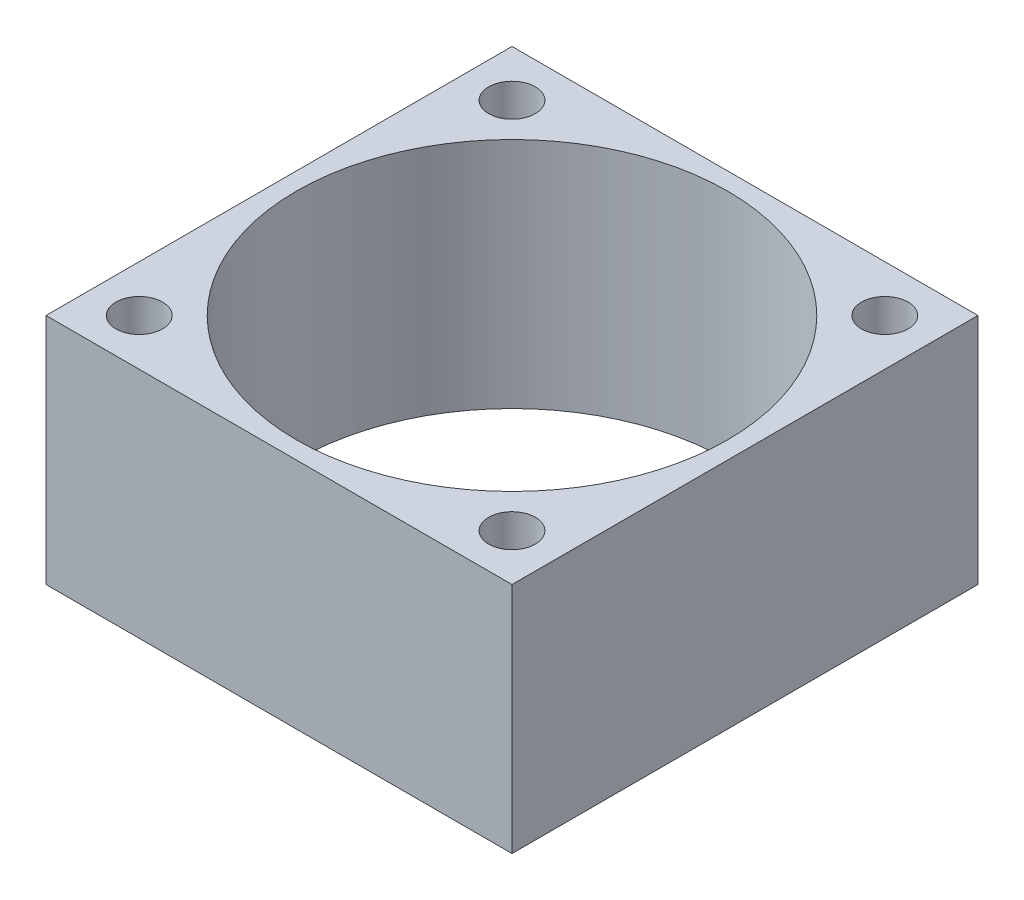
ISO-10303-21;
HEADER;
FILE_DESCRIPTION(('STEP AP214'),'2;1');
FILE_NAME('part.step','',(''),(''),'','','');
FILE_SCHEMA(('AUTOMOTIVE_DESIGN { 1 0 10303 214 1 1 1 1 }'));
ENDSEC;
DATA;
#1=APPLICATION_CONTEXT('core data for automotive mechanical design processes');
#2=APPLICATION_PROTOCOL_DEFINITION('international standard','automotive_design',2000,#1);
#3=PRODUCT_CONTEXT('',#1,'mechanical');
#4=PRODUCT('Part','Part','',(#3));
#5=PRODUCT_RELATED_PRODUCT_CATEGORY('part','',(#4));
#6=PRODUCT_DEFINITION_FORMATION('','',#4);
#7=PRODUCT_DEFINITION_CONTEXT('part definition',#1,'design');
#8=PRODUCT_DEFINITION('design','',#6,#7);
#9=PRODUCT_DEFINITION_SHAPE('','',#8);
#10=(LENGTH_UNIT() NAMED_UNIT(*) SI_UNIT(.MILLI.,.METRE.));
#11=(NAMED_UNIT(*) PLANE_ANGLE_UNIT() SI_UNIT($,.RADIAN.));
#12=(NAMED_UNIT(*) SI_UNIT($,.STERADIAN.) SOLID_ANGLE_UNIT());
#13=UNCERTAINTY_MEASURE_WITH_UNIT(LENGTH_MEASURE(1.E-05),#10,'distance_accuracy_value','');
#14=(GEOMETRIC_REPRESENTATION_CONTEXT(3) GLOBAL_UNCERTAINTY_ASSIGNED_CONTEXT((#13)) GLOBAL_UNIT_ASSIGNED_CONTEXT((#10,
#11,#12)) REPRESENTATION_CONTEXT('',''));
#15=CARTESIAN_POINT('',(0.,0.,0.));
#16=DIRECTION('',(0.,0.,1.));
#17=DIRECTION('',(1.,0.,0.));
#18=AXIS2_PLACEMENT_3D('',#15,#16,#17);
#19=CARTESIAN_POINT('',(0.,20.,0.));
#20=DIRECTION('',(0.,-1.,0.));
#21=DIRECTION('',(0.,0.,-1.));
#22=AXIS2_PLACEMENT_3D('',#19,#20,#21);
#23=PLANE('',#22);
#24=CARTESIAN_POINT('',(-36.,20.,4.));
#25=DIRECTION('',(0.,1.,0.));
#26=DIRECTION('',(0.,0.,1.));
#27=AXIS2_PLACEMENT_3D('',#24,#25,#26);
#28=CIRCLE('',#27,2.);
#29=CARTESIAN_POINT('',(-36.,20.,6.00000000000001));
#30=VERTEX_POINT('',#29);
#31=EDGE_CURVE('E140',#30,#30,#28,.T.);
#32=ORIENTED_EDGE('',*,*,#31,.F.);
#33=EDGE_LOOP('',(#32));
#34=FACE_BOUND('',#33,.T.);
#35=CARTESIAN_POINT('',(-20.,20.,20.));
#36=DIRECTION('',(0.,1.,0.));
#37=DIRECTION('',(0.,0.,1.));
#38=AXIS2_PLACEMENT_3D('',#35,#36,#37);
#39=CIRCLE('',#38,18.5);
#40=CARTESIAN_POINT('',(-20.,20.,38.5));
#41=VERTEX_POINT('',#40);
#42=EDGE_CURVE('E158',#41,#41,#39,.T.);
#43=ORIENTED_EDGE('',*,*,#42,.F.);
#44=EDGE_LOOP('',(#43));
#45=FACE_BOUND('',#44,.T.);
#46=CARTESIAN_POINT('',(-3.99999999999999,20.,4.));
#47=DIRECTION('',(0.,1.,0.));
#48=DIRECTION('',(0.,0.,1.));
#49=AXIS2_PLACEMENT_3D('',#46,#47,#48);
#50=CIRCLE('',#49,2.);
#51=CARTESIAN_POINT('',(-3.99999999999999,20.,6.));
#52=VERTEX_POINT('',#51);
#53=EDGE_CURVE('E137',#52,#52,#50,.T.);
#54=ORIENTED_EDGE('',*,*,#53,.F.);
#55=EDGE_LOOP('',(#54));
#56=FACE_BOUND('',#55,.T.);
#57=DIRECTION('',(0.,0.,-1.));
#58=VECTOR('',#57,1.);
#59=CARTESIAN_POINT('',(0.,20.,0.));
#60=LINE('',#59,#58);
#61=CARTESIAN_POINT('',(0.,20.,40.));
#62=VERTEX_POINT('',#61);
#63=CARTESIAN_POINT('',(0.,20.,0.));
#64=VERTEX_POINT('',#63);
#65=EDGE_CURVE('E108',#62,#64,#60,.T.);
#66=ORIENTED_EDGE('',*,*,#65,.T.);
#67=DIRECTION('',(-1.,0.,0.));
#68=VECTOR('',#67,1.);
#69=CARTESIAN_POINT('',(0.,20.,0.));
#70=LINE('',#69,#68);
#71=CARTESIAN_POINT('',(-40.,20.,0.));
#72=VERTEX_POINT('',#71);
#73=EDGE_CURVE('E103',#64,#72,#70,.T.);
#74=ORIENTED_EDGE('',*,*,#73,.T.);
#75=DIRECTION('',(0.,0.,1.));
#76=VECTOR('',#75,1.);
#77=CARTESIAN_POINT('',(-40.,20.,0.));
#78=LINE('',#77,#76);
#79=CARTESIAN_POINT('',(-40.,20.,40.));
#80=VERTEX_POINT('',#79);
#81=EDGE_CURVE('E106',#72,#80,#78,.T.);
#82=ORIENTED_EDGE('',*,*,#81,.T.);
#83=DIRECTION('',(1.,0.,0.));
#84=VECTOR('',#83,1.);
#85=CARTESIAN_POINT('',(0.,20.,40.));
#86=LINE('',#85,#84);
#87=EDGE_CURVE('E73',#80,#62,#86,.T.);
#88=ORIENTED_EDGE('',*,*,#87,.T.);
#89=EDGE_LOOP('',(#66,#74,#82,#88));
#90=FACE_BOUND('',#89,.T.);
#91=CARTESIAN_POINT('',(-3.99999999999999,20.,36.));
#92=DIRECTION('',(0.,-1.,0.));
#93=DIRECTION('',(0.,0.,-1.));
#94=AXIS2_PLACEMENT_3D('',#91,#92,#93);
#95=CIRCLE('',#94,2.);
#96=CARTESIAN_POINT('',(-3.99999999999999,20.,34.));
#97=VERTEX_POINT('',#96);
#98=EDGE_CURVE('E148',#97,#97,#95,.T.);
#99=ORIENTED_EDGE('',*,*,#98,.T.);
#100=EDGE_LOOP('',(#99));
#101=FACE_BOUND('',#100,.T.);
#102=CARTESIAN_POINT('',(-36.,20.,36.));
#103=DIRECTION('',(0.,-1.,0.));
#104=DIRECTION('',(0.,0.,-1.));
#105=AXIS2_PLACEMENT_3D('',#102,#103,#104);
#106=CIRCLE('',#105,2.);
#107=CARTESIAN_POINT('',(-36.,20.,34.));
#108=VERTEX_POINT('',#107);
#109=EDGE_CURVE('E141',#108,#108,#106,.T.);
#110=ORIENTED_EDGE('',*,*,#109,.T.);
#111=EDGE_LOOP('',(#110));
#112=FACE_BOUND('',#111,.T.);
#113=ADVANCED_FACE('F56',(#34,#45,#56,#90,#101,#112),#23,.F.);
#114=CARTESIAN_POINT('',(0.,0.,0.));
#115=DIRECTION('',(0.,-1.,0.));
#116=DIRECTION('',(0.,0.,-1.));
#117=AXIS2_PLACEMENT_3D('',#114,#115,#116);
#118=PLANE('',#117);
#119=CARTESIAN_POINT('',(-36.,0.,4.));
#120=DIRECTION('',(0.,-1.,0.));
#121=DIRECTION('',(0.,0.,-1.));
#122=AXIS2_PLACEMENT_3D('',#119,#120,#121);
#123=CIRCLE('',#122,2.);
#124=CARTESIAN_POINT('',(-36.,0.,2.));
#125=VERTEX_POINT('',#124);
#126=EDGE_CURVE('E144',#125,#125,#123,.F.);
#127=ORIENTED_EDGE('',*,*,#126,.T.);
#128=EDGE_LOOP('',(#127));
#129=FACE_BOUND('',#128,.T.);
#130=CARTESIAN_POINT('',(-3.99999999999999,0.,36.));
#131=DIRECTION('',(0.,-1.,0.));
#132=DIRECTION('',(0.,0.,-1.));
#133=AXIS2_PLACEMENT_3D('',#130,#131,#132);
#134=CIRCLE('',#133,2.);
#135=CARTESIAN_POINT('',(-3.99999999999999,0.,34.));
#136=VERTEX_POINT('',#135);
#137=EDGE_CURVE('E155',#136,#136,#134,.T.);
#138=ORIENTED_EDGE('',*,*,#137,.F.);
#139=EDGE_LOOP('',(#138));
#140=FACE_BOUND('',#139,.T.);
#141=CARTESIAN_POINT('',(-3.99999999999999,0.,4.));
#142=DIRECTION('',(0.,-1.,0.));
#143=DIRECTION('',(0.,0.,-1.));
#144=AXIS2_PLACEMENT_3D('',#141,#142,#143);
#145=CIRCLE('',#144,2.);
#146=CARTESIAN_POINT('',(-3.99999999999999,0.,2.));
#147=VERTEX_POINT('',#146);
#148=EDGE_CURVE('E123',#147,#147,#145,.F.);
#149=ORIENTED_EDGE('',*,*,#148,.T.);
#150=EDGE_LOOP('',(#149));
#151=FACE_BOUND('',#150,.T.);
#152=DIRECTION('',(0.,0.,-1.));
#153=VECTOR('',#152,1.);
#154=CARTESIAN_POINT('',(0.,0.,0.));
#155=LINE('',#154,#153);
#156=CARTESIAN_POINT('',(0.,0.,40.));
#157=VERTEX_POINT('',#156);
#158=CARTESIAN_POINT('',(0.,0.,0.));
#159=VERTEX_POINT('',#158);
#160=EDGE_CURVE('E120',#157,#159,#155,.T.);
#161=ORIENTED_EDGE('',*,*,#160,.F.);
#162=DIRECTION('',(1.,0.,0.));
#163=VECTOR('',#162,1.);
#164=CARTESIAN_POINT('',(0.,0.,40.));
#165=LINE('',#164,#163);
#166=CARTESIAN_POINT('',(-40.,0.,40.));
#167=VERTEX_POINT('',#166);
#168=EDGE_CURVE('E96',#167,#157,#165,.T.);
#169=ORIENTED_EDGE('',*,*,#168,.F.);
#170=DIRECTION('',(0.,0.,1.));
#171=VECTOR('',#170,1.);
#172=CARTESIAN_POINT('',(-40.,0.,0.));
#173=LINE('',#172,#171);
#174=CARTESIAN_POINT('',(-40.,0.,0.));
#175=VERTEX_POINT('',#174);
#176=EDGE_CURVE('E90',#175,#167,#173,.T.);
#177=ORIENTED_EDGE('',*,*,#176,.F.);
#178=DIRECTION('',(-1.,0.,0.));
#179=VECTOR('',#178,1.);
#180=CARTESIAN_POINT('',(0.,0.,0.));
#181=LINE('',#180,#179);
#182=EDGE_CURVE('E112',#159,#175,#181,.T.);
#183=ORIENTED_EDGE('',*,*,#182,.F.);
#184=EDGE_LOOP('',(#161,#169,#177,#183));
#185=FACE_BOUND('',#184,.T.);
#186=CARTESIAN_POINT('',(-20.,0.,20.));
#187=DIRECTION('',(0.,-1.,0.));
#188=DIRECTION('',(0.,0.,-1.));
#189=AXIS2_PLACEMENT_3D('',#186,#187,#188);
#190=CIRCLE('',#189,18.5);
#191=CARTESIAN_POINT('',(-20.,0.,1.5));
#192=VERTEX_POINT('',#191);
#193=EDGE_CURVE('E161',#192,#192,#190,.F.);
#194=ORIENTED_EDGE('',*,*,#193,.T.);
#195=EDGE_LOOP('',(#194));
#196=FACE_BOUND('',#195,.T.);
#197=CARTESIAN_POINT('',(-36.,0.,36.));
#198=DIRECTION('',(0.,-1.,0.));
#199=DIRECTION('',(0.,0.,-1.));
#200=AXIS2_PLACEMENT_3D('',#197,#198,#199);
#201=CIRCLE('',#200,2.);
#202=CARTESIAN_POINT('',(-36.,0.,34.));
#203=VERTEX_POINT('',#202);
#204=EDGE_CURVE('E145',#203,#203,#201,.T.);
#205=ORIENTED_EDGE('',*,*,#204,.F.);
#206=EDGE_LOOP('',(#205));
#207=FACE_BOUND('',#206,.T.);
#208=ADVANCED_FACE('F131',(#129,#140,#151,#185,#196,#207),#118,.T.);
#209=CARTESIAN_POINT('',(0.,20.,0.));
#210=DIRECTION('',(-1.,0.,0.));
#211=DIRECTION('',(0.,0.,1.));
#212=AXIS2_PLACEMENT_3D('',#209,#210,#211);
#213=PLANE('',#212);
#214=ORIENTED_EDGE('',*,*,#160,.T.);
#215=DIRECTION('',(0.,-1.,0.));
#216=VECTOR('',#215,1.);
#217=CARTESIAN_POINT('',(0.,20.,0.));
#218=LINE('',#217,#216);
#219=EDGE_CURVE('E12',#64,#159,#218,.T.);
#220=ORIENTED_EDGE('',*,*,#219,.F.);
#221=ORIENTED_EDGE('',*,*,#65,.F.);
#222=DIRECTION('',(0.,-1.,0.));
#223=VECTOR('',#222,1.);
#224=CARTESIAN_POINT('',(0.,20.,40.));
#225=LINE('',#224,#223);
#226=EDGE_CURVE('E116',#62,#157,#225,.T.);
#227=ORIENTED_EDGE('',*,*,#226,.T.);
#228=EDGE_LOOP('',(#214,#220,#221,#227));
#229=FACE_BOUND('',#228,.T.);
#230=ADVANCED_FACE('F58',(#229),#213,.F.);
#231=CARTESIAN_POINT('',(0.,20.,0.));
#232=DIRECTION('',(0.,0.,1.));
#233=DIRECTION('',(1.,0.,0.));
#234=AXIS2_PLACEMENT_3D('',#231,#232,#233);
#235=PLANE('',#234);
#236=ORIENTED_EDGE('',*,*,#182,.T.);
#237=DIRECTION('',(0.,-1.,0.));
#238=VECTOR('',#237,1.);
#239=CARTESIAN_POINT('',(-40.,20.,0.));
#240=LINE('',#239,#238);
#241=EDGE_CURVE('E65',#72,#175,#240,.T.);
#242=ORIENTED_EDGE('',*,*,#241,.F.);
#243=ORIENTED_EDGE('',*,*,#73,.F.);
#244=ORIENTED_EDGE('',*,*,#219,.T.);
#245=EDGE_LOOP('',(#236,#242,#243,#244));
#246=FACE_BOUND('',#245,.T.);
#247=ADVANCED_FACE('F111',(#246),#235,.F.);
#248=CARTESIAN_POINT('',(-40.,20.,0.));
#249=DIRECTION('',(1.,0.,0.));
#250=DIRECTION('',(0.,0.,-1.));
#251=AXIS2_PLACEMENT_3D('',#248,#249,#250);
#252=PLANE('',#251);
#253=ORIENTED_EDGE('',*,*,#176,.T.);
#254=DIRECTION('',(0.,-1.,0.));
#255=VECTOR('',#254,1.);
#256=CARTESIAN_POINT('',(-40.,20.,40.));
#257=LINE('',#256,#255);
#258=EDGE_CURVE('E113',#80,#167,#257,.T.);
#259=ORIENTED_EDGE('',*,*,#258,.F.);
#260=ORIENTED_EDGE('',*,*,#81,.F.);
#261=ORIENTED_EDGE('',*,*,#241,.T.);
#262=EDGE_LOOP('',(#253,#259,#260,#261));
#263=FACE_BOUND('',#262,.T.);
#264=ADVANCED_FACE('F114',(#263),#252,.F.);
#265=CARTESIAN_POINT('',(0.,20.,40.));
#266=DIRECTION('',(0.,0.,-1.));
#267=DIRECTION('',(-1.,0.,0.));
#268=AXIS2_PLACEMENT_3D('',#265,#266,#267);
#269=PLANE('',#268);
#270=ORIENTED_EDGE('',*,*,#168,.T.);
#271=ORIENTED_EDGE('',*,*,#226,.F.);
#272=ORIENTED_EDGE('',*,*,#87,.F.);
#273=ORIENTED_EDGE('',*,*,#258,.T.);
#274=EDGE_LOOP('',(#270,#271,#272,#273));
#275=FACE_BOUND('',#274,.T.);
#276=ADVANCED_FACE('F128',(#275),#269,.F.);
#277=CARTESIAN_POINT('',(-3.99999999999999,-52.3259018078045,4.));
#278=DIRECTION('',(0.,1.,0.));
#279=DIRECTION('',(0.,0.,1.));
#280=AXIS2_PLACEMENT_3D('',#277,#278,#279);
#281=CYLINDRICAL_SURFACE('',#280,2.);
#282=ORIENTED_EDGE('',*,*,#53,.T.);
#283=EDGE_LOOP('',(#282));
#284=FACE_BOUND('',#283,.T.);
#285=ORIENTED_EDGE('',*,*,#148,.F.);
#286=EDGE_LOOP('',(#285));
#287=FACE_BOUND('',#286,.T.);
#288=ADVANCED_FACE('F179',(#284,#287),#281,.F.);
#289=CARTESIAN_POINT('',(-3.99999999999999,-52.3259018078045,36.));
#290=DIRECTION('',(0.,1.,0.));
#291=DIRECTION('',(0.,0.,1.));
#292=AXIS2_PLACEMENT_3D('',#289,#290,#291);
#293=CYLINDRICAL_SURFACE('',#292,2.);
#294=ORIENTED_EDGE('',*,*,#98,.F.);
#295=EDGE_LOOP('',(#294));
#296=FACE_BOUND('',#295,.T.);
#297=ORIENTED_EDGE('',*,*,#137,.T.);
#298=EDGE_LOOP('',(#297));
#299=FACE_BOUND('',#298,.T.);
#300=ADVANCED_FACE('F169',(#296,#299),#293,.F.);
#301=CARTESIAN_POINT('',(-20.,-52.3259018078045,20.));
#302=DIRECTION('',(0.,1.,0.));
#303=DIRECTION('',(0.,0.,1.));
#304=AXIS2_PLACEMENT_3D('',#301,#302,#303);
#305=CYLINDRICAL_SURFACE('',#304,18.5);
#306=ORIENTED_EDGE('',*,*,#42,.T.);
#307=EDGE_LOOP('',(#306));
#308=FACE_BOUND('',#307,.T.);
#309=ORIENTED_EDGE('',*,*,#193,.F.);
#310=EDGE_LOOP('',(#309));
#311=FACE_BOUND('',#310,.T.);
#312=ADVANCED_FACE('F166',(#308,#311),#305,.F.);
#313=CARTESIAN_POINT('',(-36.,-52.3259018078045,36.));
#314=DIRECTION('',(0.,1.,0.));
#315=DIRECTION('',(0.,0.,1.));
#316=AXIS2_PLACEMENT_3D('',#313,#314,#315);
#317=CYLINDRICAL_SURFACE('',#316,2.);
#318=ORIENTED_EDGE('',*,*,#109,.F.);
#319=EDGE_LOOP('',(#318));
#320=FACE_BOUND('',#319,.T.);
#321=ORIENTED_EDGE('',*,*,#204,.T.);
#322=EDGE_LOOP('',(#321));
#323=FACE_BOUND('',#322,.T.);
#324=ADVANCED_FACE('F168',(#320,#323),#317,.F.);
#325=CARTESIAN_POINT('',(-36.,-52.3259018078045,4.));
#326=DIRECTION('',(0.,1.,0.));
#327=DIRECTION('',(0.,0.,1.));
#328=AXIS2_PLACEMENT_3D('',#325,#326,#327);
#329=CYLINDRICAL_SURFACE('',#328,2.);
#330=ORIENTED_EDGE('',*,*,#31,.T.);
#331=EDGE_LOOP('',(#330));
#332=FACE_BOUND('',#331,.T.);
#333=ORIENTED_EDGE('',*,*,#126,.F.);
#334=EDGE_LOOP('',(#333));
#335=FACE_BOUND('',#334,.T.);
#336=ADVANCED_FACE('F176',(#332,#335),#329,.F.);
#337=CLOSED_SHELL('',(#113,#208,#230,#247,#264,#276,#288,#300,#312,#324,#336));
#338=MANIFOLD_SOLID_BREP('B2',#337);
#339=ADVANCED_BREP_SHAPE_REPRESENTATION('',(#18,#338),#14);
#340=SHAPE_DEFINITION_REPRESENTATION(#9,#339);
ENDSEC;
END-ISO-10303-21;
